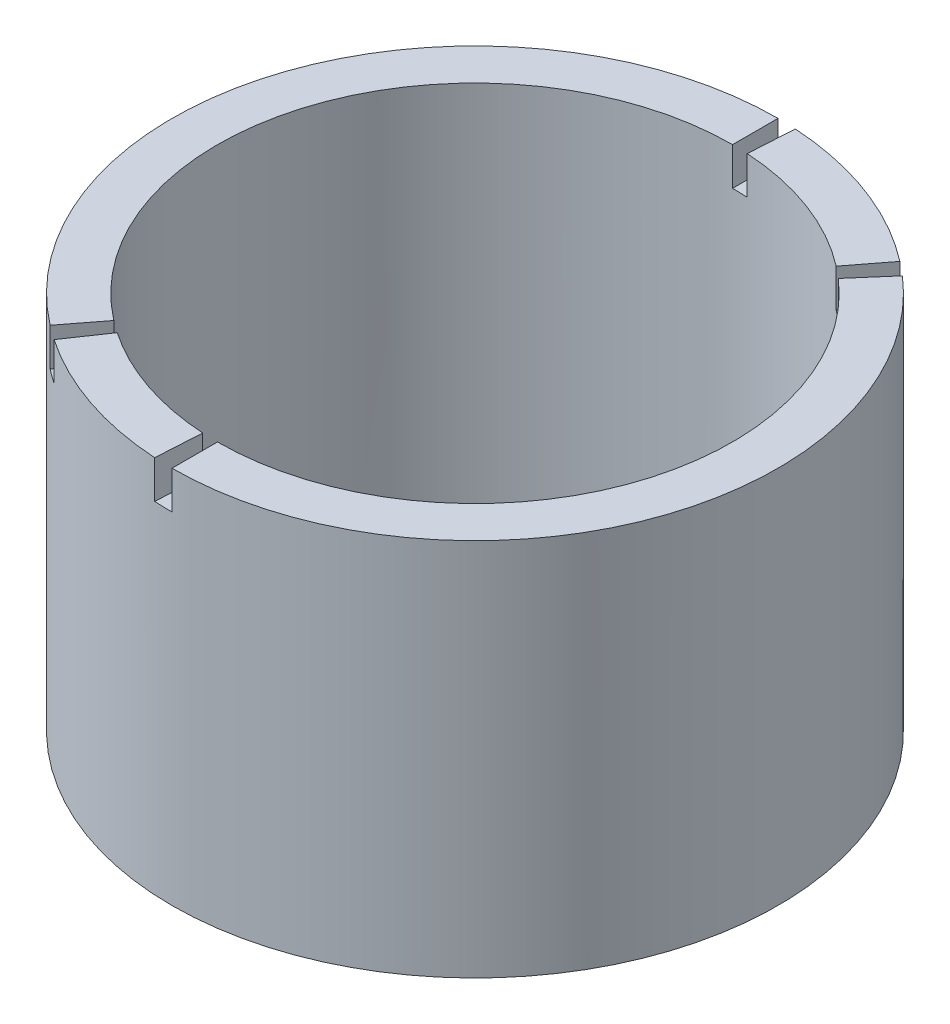
ISO-10303-21;
HEADER;
FILE_DESCRIPTION(('STEP AP214'),'2;1');
FILE_NAME('part.step','',(''),(''),'','','');
FILE_SCHEMA(('AUTOMOTIVE_DESIGN { 1 0 10303 214 1 1 1 1 }'));
ENDSEC;
DATA;
#1=APPLICATION_CONTEXT('core data for automotive mechanical design processes');
#2=APPLICATION_PROTOCOL_DEFINITION('international standard','automotive_design',2000,#1);
#3=PRODUCT_CONTEXT('',#1,'mechanical');
#4=PRODUCT('Part','Part','',(#3));
#5=PRODUCT_RELATED_PRODUCT_CATEGORY('part','',(#4));
#6=PRODUCT_DEFINITION_FORMATION('','',#4);
#7=PRODUCT_DEFINITION_CONTEXT('part definition',#1,'design');
#8=PRODUCT_DEFINITION('design','',#6,#7);
#9=PRODUCT_DEFINITION_SHAPE('','',#8);
#10=(LENGTH_UNIT() NAMED_UNIT(*) SI_UNIT(.MILLI.,.METRE.));
#11=(NAMED_UNIT(*) PLANE_ANGLE_UNIT() SI_UNIT($,.RADIAN.));
#12=(NAMED_UNIT(*) SI_UNIT($,.STERADIAN.) SOLID_ANGLE_UNIT());
#13=UNCERTAINTY_MEASURE_WITH_UNIT(LENGTH_MEASURE(1.E-05),#10,'distance_accuracy_value','');
#14=(GEOMETRIC_REPRESENTATION_CONTEXT(3) GLOBAL_UNCERTAINTY_ASSIGNED_CONTEXT((#13)) GLOBAL_UNIT_ASSIGNED_CONTEXT((#10,
#11,#12)) REPRESENTATION_CONTEXT('',''));
#15=CARTESIAN_POINT('',(0.,0.,0.));
#16=DIRECTION('',(0.,0.,1.));
#17=DIRECTION('',(1.,0.,0.));
#18=AXIS2_PLACEMENT_3D('',#15,#16,#17);
#19=CARTESIAN_POINT('',(0.,50.,0.));
#20=DIRECTION('',(0.,1.,0.));
#21=DIRECTION('',(0.,0.,1.));
#22=AXIS2_PLACEMENT_3D('',#19,#20,#21);
#23=PLANE('',#22);
#24=DIRECTION('',(-0.609890101839661,0.,0.792486002196889));
#25=VECTOR('',#24,1.);
#26=CARTESIAN_POINT('',(-24.3956040735864,50.,31.6994400878756));
#27=LINE('',#26,#25);
#28=CARTESIAN_POINT('',(-20.7362634625485,50.,26.9445240746942));
#29=VERTEX_POINT('',#28);
#30=CARTESIAN_POINT('',(-24.3956040735864,50.,31.6994400878756));
#31=VERTEX_POINT('',#30);
#32=EDGE_CURVE('E161',#29,#31,#27,.T.);
#33=ORIENTED_EDGE('',*,*,#32,.F.);
#34=CARTESIAN_POINT('',(0.,50.,0.));
#35=DIRECTION('',(0.,1.,0.));
#36=DIRECTION('',(0.,0.,1.));
#37=AXIS2_PLACEMENT_3D('',#34,#35,#36);
#38=CIRCLE('',#37,34.);
#39=CARTESIAN_POINT('',(0.,50.,-34.));
#40=VERTEX_POINT('',#39);
#41=EDGE_CURVE('E247',#40,#29,#38,.T.);
#42=ORIENTED_EDGE('',*,*,#41,.F.);
#43=DIRECTION('',(0.,0.,1.));
#44=VECTOR('',#43,1.);
#45=CARTESIAN_POINT('',(0.,50.,-40.));
#46=LINE('',#45,#44);
#47=CARTESIAN_POINT('',(0.,50.,-40.));
#48=VERTEX_POINT('',#47);
#49=EDGE_CURVE('E213',#48,#40,#46,.T.);
#50=ORIENTED_EDGE('',*,*,#49,.F.);
#51=CARTESIAN_POINT('',(0.,50.,0.));
#52=DIRECTION('',(0.,1.,0.));
#53=DIRECTION('',(0.,0.,1.));
#54=AXIS2_PLACEMENT_3D('',#51,#52,#53);
#55=CIRCLE('',#54,40.);
#56=EDGE_CURVE('E11',#48,#31,#55,.T.);
#57=ORIENTED_EDGE('',*,*,#56,.T.);
#58=EDGE_LOOP('',(#33,#42,#50,#57));
#59=FACE_BOUND('',#58,.T.);
#60=ADVANCED_FACE('F31',(#59),#23,.T.);
#61=DIRECTION('',(0.655431584963321,0.,-0.7552545514146));
#62=VECTOR('',#61,1.);
#63=CARTESIAN_POINT('',(26.2172633985329,50.,-30.210182056584));
#64=LINE('',#63,#62);
#65=CARTESIAN_POINT('',(22.2846738887529,50.,-25.6786547480964));
#66=VERTEX_POINT('',#65);
#67=CARTESIAN_POINT('',(26.2172633985329,50.,-30.210182056584));
#68=VERTEX_POINT('',#67);
#69=EDGE_CURVE('E174',#66,#68,#64,.T.);
#70=ORIENTED_EDGE('',*,*,#69,.F.);
#71=CARTESIAN_POINT('',(0.,50.,34.));
#72=VERTEX_POINT('',#71);
#73=EDGE_CURVE('E251',#72,#66,#38,.T.);
#74=ORIENTED_EDGE('',*,*,#73,.F.);
#75=DIRECTION('',(0.,0.,-1.));
#76=VECTOR('',#75,1.);
#77=CARTESIAN_POINT('',(0.,50.,40.));
#78=LINE('',#77,#76);
#79=CARTESIAN_POINT('',(0.,50.,40.));
#80=VERTEX_POINT('',#79);
#81=EDGE_CURVE('E189',#80,#72,#78,.T.);
#82=ORIENTED_EDGE('',*,*,#81,.F.);
#83=EDGE_CURVE('E41',#80,#68,#55,.T.);
#84=ORIENTED_EDGE('',*,*,#83,.T.);
#85=EDGE_LOOP('',(#70,#74,#82,#84));
#86=FACE_BOUND('',#85,.T.);
#87=ADVANCED_FACE('F291',(#86),#23,.T.);
#88=DIRECTION('',(0.562238272342853,0.,-0.826975286881612));
#89=VECTOR('',#88,1.);
#90=CARTESIAN_POINT('',(-22.4895308937141,50.,33.0790114752645));
#91=LINE('',#90,#89);
#92=CARTESIAN_POINT('',(-22.4895308937141,50.,33.0790114752645));
#93=VERTEX_POINT('',#92);
#94=CARTESIAN_POINT('',(-19.116101259657,50.,28.1171597539748));
#95=VERTEX_POINT('',#94);
#96=EDGE_CURVE('E272',#93,#95,#91,.T.);
#97=ORIENTED_EDGE('',*,*,#96,.F.);
#98=CARTESIAN_POINT('',(-2.35294117647058,50.,39.9307358787697));
#99=VERTEX_POINT('',#98);
#100=EDGE_CURVE('E40',#93,#99,#55,.T.);
#101=ORIENTED_EDGE('',*,*,#100,.T.);
#102=DIRECTION('',(-0.0588235294117646,0.,0.998268396969244));
#103=VECTOR('',#102,1.);
#104=CARTESIAN_POINT('',(-2.35294117647058,50.,39.9307358787697));
#105=LINE('',#104,#103);
#106=CARTESIAN_POINT('',(-2.00000000000001,50.,33.9411254969543));
#107=VERTEX_POINT('',#106);
#108=EDGE_CURVE('E200',#107,#99,#105,.T.);
#109=ORIENTED_EDGE('',*,*,#108,.F.);
#110=EDGE_CURVE('E250',#95,#107,#38,.T.);
#111=ORIENTED_EDGE('',*,*,#110,.F.);
#112=EDGE_LOOP('',(#97,#101,#109,#111));
#113=FACE_BOUND('',#112,.T.);
#114=ADVANCED_FACE('F271',(#113),#23,.T.);
#115=DIRECTION('',(-0.609890101839661,0.,0.792486002196889));
#116=VECTOR('',#115,1.);
#117=CARTESIAN_POINT('',(24.3956040735864,50.,-31.6994400878756));
#118=LINE('',#117,#116);
#119=CARTESIAN_POINT('',(24.3956040735864,50.,-31.6994400878756));
#120=VERTEX_POINT('',#119);
#121=CARTESIAN_POINT('',(20.7362634625485,50.,-26.9445240746942));
#122=VERTEX_POINT('',#121);
#123=EDGE_CURVE('E182',#120,#122,#118,.T.);
#124=ORIENTED_EDGE('',*,*,#123,.F.);
#125=CARTESIAN_POINT('',(2.35294117647058,50.,-39.9307358787697));
#126=VERTEX_POINT('',#125);
#127=EDGE_CURVE('E273',#120,#126,#55,.T.);
#128=ORIENTED_EDGE('',*,*,#127,.T.);
#129=DIRECTION('',(0.0588235294117643,0.,-0.998268396969244));
#130=VECTOR('',#129,1.);
#131=CARTESIAN_POINT('',(2.35294117647058,50.,-39.9307358787697));
#132=LINE('',#131,#130);
#133=CARTESIAN_POINT('',(1.99999999999999,50.,-33.9411254969543));
#134=VERTEX_POINT('',#133);
#135=EDGE_CURVE('E225',#134,#126,#132,.T.);
#136=ORIENTED_EDGE('',*,*,#135,.F.);
#137=EDGE_CURVE('E253',#122,#134,#38,.T.);
#138=ORIENTED_EDGE('',*,*,#137,.F.);
#139=EDGE_LOOP('',(#124,#128,#136,#138));
#140=FACE_BOUND('',#139,.T.);
#141=ADVANCED_FACE('F284',(#140),#23,.T.);
#142=CARTESIAN_POINT('',(0.,0.,0.));
#143=DIRECTION('',(0.,1.,0.));
#144=DIRECTION('',(0.,0.,1.));
#145=AXIS2_PLACEMENT_3D('',#142,#143,#144);
#146=PLANE('',#145);
#147=CARTESIAN_POINT('',(0.,0.,0.));
#148=DIRECTION('',(0.,1.,0.));
#149=DIRECTION('',(0.,0.,1.));
#150=AXIS2_PLACEMENT_3D('',#147,#148,#149);
#151=CIRCLE('',#150,40.);
#152=CARTESIAN_POINT('',(0.,0.,40.));
#153=VERTEX_POINT('',#152);
#154=EDGE_CURVE('E35',#153,#153,#151,.T.);
#155=ORIENTED_EDGE('',*,*,#154,.F.);
#156=EDGE_LOOP('',(#155));
#157=FACE_BOUND('',#156,.T.);
#158=CARTESIAN_POINT('',(0.,0.,0.));
#159=DIRECTION('',(0.,1.,0.));
#160=DIRECTION('',(0.,0.,1.));
#161=AXIS2_PLACEMENT_3D('',#158,#159,#160);
#162=CIRCLE('',#161,34.);
#163=CARTESIAN_POINT('',(0.,0.,34.));
#164=VERTEX_POINT('',#163);
#165=EDGE_CURVE('E239',#164,#164,#162,.T.);
#166=ORIENTED_EDGE('',*,*,#165,.T.);
#167=EDGE_LOOP('',(#166));
#168=FACE_BOUND('',#167,.T.);
#169=ADVANCED_FACE('F282',(#157,#168),#146,.F.);
#170=CARTESIAN_POINT('',(0.,50.,0.));
#171=DIRECTION('',(0.,-1.,0.));
#172=DIRECTION('',(0.,0.,-1.));
#173=AXIS2_PLACEMENT_3D('',#170,#171,#172);
#174=CYLINDRICAL_SURFACE('',#173,40.);
#175=CARTESIAN_POINT('',(0.,45.,0.));
#176=DIRECTION('',(0.,1.,0.));
#177=DIRECTION('',(0.,0.,-1.));
#178=AXIS2_PLACEMENT_3D('',#175,#176,#177);
#179=CIRCLE('',#178,40.);
#180=CARTESIAN_POINT('',(-24.3956040735864,45.,31.6994400878756));
#181=VERTEX_POINT('',#180);
#182=CARTESIAN_POINT('',(-22.4895308937141,45.,33.0790114752645));
#183=VERTEX_POINT('',#182);
#184=EDGE_CURVE('E152',#181,#183,#179,.T.);
#185=ORIENTED_EDGE('',*,*,#184,.F.);
#186=DIRECTION('',(0.,1.,0.));
#187=VECTOR('',#186,1.);
#188=CARTESIAN_POINT('',(-24.3956040735864,45.,31.6994400878756));
#189=LINE('',#188,#187);
#190=EDGE_CURVE('E184',#181,#31,#189,.T.);
#191=ORIENTED_EDGE('',*,*,#190,.T.);
#192=ORIENTED_EDGE('',*,*,#56,.F.);
#193=DIRECTION('',(0.,1.,0.));
#194=VECTOR('',#193,1.);
#195=CARTESIAN_POINT('',(0.,45.,-40.));
#196=LINE('',#195,#194);
#197=CARTESIAN_POINT('',(0.,45.,-40.));
#198=VERTEX_POINT('',#197);
#199=EDGE_CURVE('E232',#198,#48,#196,.T.);
#200=ORIENTED_EDGE('',*,*,#199,.F.);
#201=CARTESIAN_POINT('',(0.,45.,0.));
#202=DIRECTION('',(0.,1.,0.));
#203=DIRECTION('',(0.,0.,-1.));
#204=AXIS2_PLACEMENT_3D('',#201,#202,#203);
#205=CIRCLE('',#204,40.);
#206=CARTESIAN_POINT('',(2.35294117647058,45.,-39.9307358787697));
#207=VERTEX_POINT('',#206);
#208=EDGE_CURVE('E221',#207,#198,#205,.T.);
#209=ORIENTED_EDGE('',*,*,#208,.F.);
#210=DIRECTION('',(0.,1.,0.));
#211=VECTOR('',#210,1.);
#212=CARTESIAN_POINT('',(2.35294117647058,45.,-39.9307358787697));
#213=LINE('',#212,#211);
#214=EDGE_CURVE('E236',#207,#126,#213,.T.);
#215=ORIENTED_EDGE('',*,*,#214,.T.);
#216=ORIENTED_EDGE('',*,*,#127,.F.);
#217=DIRECTION('',(0.,1.,0.));
#218=VECTOR('',#217,1.);
#219=CARTESIAN_POINT('',(24.3956040735864,45.,-31.6994400878756));
#220=LINE('',#219,#218);
#221=CARTESIAN_POINT('',(24.3956040735864,45.,-31.6994400878756));
#222=VERTEX_POINT('',#221);
#223=EDGE_CURVE('E181',#222,#120,#220,.T.);
#224=ORIENTED_EDGE('',*,*,#223,.F.);
#225=CARTESIAN_POINT('',(0.,45.,0.));
#226=DIRECTION('',(0.,1.,0.));
#227=DIRECTION('',(0.,0.,-1.));
#228=AXIS2_PLACEMENT_3D('',#225,#226,#227);
#229=CIRCLE('',#228,40.);
#230=CARTESIAN_POINT('',(26.2172633985329,45.,-30.210182056584));
#231=VERTEX_POINT('',#230);
#232=EDGE_CURVE('E172',#231,#222,#229,.T.);
#233=ORIENTED_EDGE('',*,*,#232,.F.);
#234=DIRECTION('',(0.,1.,0.));
#235=VECTOR('',#234,1.);
#236=CARTESIAN_POINT('',(26.2172633985329,45.,-30.210182056584));
#237=LINE('',#236,#235);
#238=EDGE_CURVE('E186',#231,#68,#237,.T.);
#239=ORIENTED_EDGE('',*,*,#238,.T.);
#240=ORIENTED_EDGE('',*,*,#83,.F.);
#241=DIRECTION('',(0.,1.,0.));
#242=VECTOR('',#241,1.);
#243=CARTESIAN_POINT('',(0.,45.,40.));
#244=LINE('',#243,#242);
#245=CARTESIAN_POINT('',(0.,45.,40.));
#246=VERTEX_POINT('',#245);
#247=EDGE_CURVE('E207',#246,#80,#244,.T.);
#248=ORIENTED_EDGE('',*,*,#247,.F.);
#249=CARTESIAN_POINT('',(0.,45.,0.));
#250=DIRECTION('',(0.,1.,0.));
#251=DIRECTION('',(0.,0.,1.));
#252=AXIS2_PLACEMENT_3D('',#249,#250,#251);
#253=CIRCLE('',#252,40.);
#254=CARTESIAN_POINT('',(-2.35294117647058,45.,39.9307358787697));
#255=VERTEX_POINT('',#254);
#256=EDGE_CURVE('E196',#255,#246,#253,.T.);
#257=ORIENTED_EDGE('',*,*,#256,.F.);
#258=DIRECTION('',(0.,1.,0.));
#259=VECTOR('',#258,1.);
#260=CARTESIAN_POINT('',(-2.35294117647058,45.,39.9307358787697));
#261=LINE('',#260,#259);
#262=EDGE_CURVE('E211',#255,#99,#261,.T.);
#263=ORIENTED_EDGE('',*,*,#262,.T.);
#264=ORIENTED_EDGE('',*,*,#100,.F.);
#265=DIRECTION('',(0.,1.,0.));
#266=VECTOR('',#265,1.);
#267=CARTESIAN_POINT('',(-22.4895308937141,45.,33.0790114752645));
#268=LINE('',#267,#266);
#269=EDGE_CURVE('E146',#183,#93,#268,.T.);
#270=ORIENTED_EDGE('',*,*,#269,.F.);
#271=EDGE_LOOP('',(#185,#191,#192,#200,#209,#215,#216,#224,#233,#239,#240,#248,#257,#263,#264,#270));
#272=FACE_BOUND('',#271,.T.);
#273=ORIENTED_EDGE('',*,*,#154,.T.);
#274=EDGE_LOOP('',(#273));
#275=FACE_BOUND('',#274,.T.);
#276=ADVANCED_FACE('F33',(#272,#275),#174,.T.);
#277=CARTESIAN_POINT('',(0.,50.,0.));
#278=DIRECTION('',(0.,-1.,0.));
#279=DIRECTION('',(0.,0.,-1.));
#280=AXIS2_PLACEMENT_3D('',#277,#278,#279);
#281=CYLINDRICAL_SURFACE('',#280,34.);
#282=DIRECTION('',(0.,1.,0.));
#283=VECTOR('',#282,1.);
#284=CARTESIAN_POINT('',(-20.7362634625485,45.,26.9445240746942));
#285=LINE('',#284,#283);
#286=CARTESIAN_POINT('',(-20.7362634625485,45.,26.9445240746942));
#287=VERTEX_POINT('',#286);
#288=EDGE_CURVE('E167',#287,#29,#285,.T.);
#289=ORIENTED_EDGE('',*,*,#288,.F.);
#290=CARTESIAN_POINT('',(0.,45.,0.));
#291=DIRECTION('',(0.,-1.,0.));
#292=DIRECTION('',(0.,0.,-1.));
#293=AXIS2_PLACEMENT_3D('',#290,#291,#292);
#294=CIRCLE('',#293,34.);
#295=CARTESIAN_POINT('',(-19.116101259657,45.,28.1171597539748));
#296=VERTEX_POINT('',#295);
#297=EDGE_CURVE('E151',#296,#287,#294,.T.);
#298=ORIENTED_EDGE('',*,*,#297,.F.);
#299=DIRECTION('',(0.,1.,0.));
#300=VECTOR('',#299,1.);
#301=CARTESIAN_POINT('',(-19.116101259657,45.,28.1171597539748));
#302=LINE('',#301,#300);
#303=EDGE_CURVE('E149',#296,#95,#302,.T.);
#304=ORIENTED_EDGE('',*,*,#303,.T.);
#305=ORIENTED_EDGE('',*,*,#110,.T.);
#306=DIRECTION('',(0.,1.,0.));
#307=VECTOR('',#306,1.);
#308=CARTESIAN_POINT('',(-2.00000000000001,45.,33.9411254969543));
#309=LINE('',#308,#307);
#310=CARTESIAN_POINT('',(-2.00000000000001,45.,33.9411254969543));
#311=VERTEX_POINT('',#310);
#312=EDGE_CURVE('E214',#311,#107,#309,.T.);
#313=ORIENTED_EDGE('',*,*,#312,.F.);
#314=CARTESIAN_POINT('',(0.,45.,0.));
#315=DIRECTION('',(0.,-1.,0.));
#316=DIRECTION('',(0.,0.,1.));
#317=AXIS2_PLACEMENT_3D('',#314,#315,#316);
#318=CIRCLE('',#317,34.);
#319=CARTESIAN_POINT('',(0.,45.,34.));
#320=VERTEX_POINT('',#319);
#321=EDGE_CURVE('E202',#320,#311,#318,.T.);
#322=ORIENTED_EDGE('',*,*,#321,.F.);
#323=DIRECTION('',(0.,1.,0.));
#324=VECTOR('',#323,1.);
#325=CARTESIAN_POINT('',(0.,45.,34.));
#326=LINE('',#325,#324);
#327=EDGE_CURVE('E217',#320,#72,#326,.T.);
#328=ORIENTED_EDGE('',*,*,#327,.T.);
#329=ORIENTED_EDGE('',*,*,#73,.T.);
#330=DIRECTION('',(0.,1.,0.));
#331=VECTOR('',#330,1.);
#332=CARTESIAN_POINT('',(22.2846738887529,45.,-25.6786547480964));
#333=LINE('',#332,#331);
#334=CARTESIAN_POINT('',(22.2846738887529,45.,-25.6786547480964));
#335=VERTEX_POINT('',#334);
#336=EDGE_CURVE('E190',#335,#66,#333,.T.);
#337=ORIENTED_EDGE('',*,*,#336,.F.);
#338=CARTESIAN_POINT('',(0.,45.,0.));
#339=DIRECTION('',(0.,-1.,0.));
#340=DIRECTION('',(0.,0.,-1.));
#341=AXIS2_PLACEMENT_3D('',#338,#339,#340);
#342=CIRCLE('',#341,34.);
#343=CARTESIAN_POINT('',(20.7362634625485,45.,-26.9445240746942));
#344=VERTEX_POINT('',#343);
#345=EDGE_CURVE('E176',#344,#335,#342,.T.);
#346=ORIENTED_EDGE('',*,*,#345,.F.);
#347=DIRECTION('',(0.,1.,0.));
#348=VECTOR('',#347,1.);
#349=CARTESIAN_POINT('',(20.7362634625485,45.,-26.9445240746942));
#350=LINE('',#349,#348);
#351=EDGE_CURVE('E192',#344,#122,#350,.T.);
#352=ORIENTED_EDGE('',*,*,#351,.T.);
#353=ORIENTED_EDGE('',*,*,#137,.T.);
#354=DIRECTION('',(0.,1.,0.));
#355=VECTOR('',#354,1.);
#356=CARTESIAN_POINT('',(1.99999999999999,45.,-33.9411254969543));
#357=LINE('',#356,#355);
#358=CARTESIAN_POINT('',(1.99999999999999,45.,-33.9411254969543));
#359=VERTEX_POINT('',#358);
#360=EDGE_CURVE('E240',#359,#134,#357,.T.);
#361=ORIENTED_EDGE('',*,*,#360,.F.);
#362=CARTESIAN_POINT('',(0.,45.,0.));
#363=DIRECTION('',(0.,-1.,0.));
#364=DIRECTION('',(0.,0.,-1.));
#365=AXIS2_PLACEMENT_3D('',#362,#363,#364);
#366=CIRCLE('',#365,34.);
#367=CARTESIAN_POINT('',(0.,45.,-34.));
#368=VERTEX_POINT('',#367);
#369=EDGE_CURVE('E227',#368,#359,#366,.T.);
#370=ORIENTED_EDGE('',*,*,#369,.F.);
#371=DIRECTION('',(0.,1.,0.));
#372=VECTOR('',#371,1.);
#373=CARTESIAN_POINT('',(0.,45.,-34.));
#374=LINE('',#373,#372);
#375=EDGE_CURVE('E243',#368,#40,#374,.T.);
#376=ORIENTED_EDGE('',*,*,#375,.T.);
#377=ORIENTED_EDGE('',*,*,#41,.T.);
#378=EDGE_LOOP('',(#289,#298,#304,#305,#313,#322,#328,#329,#337,#346,#352,#353,#361,#370,#376,#377));
#379=FACE_BOUND('',#378,.T.);
#380=ORIENTED_EDGE('',*,*,#165,.F.);
#381=EDGE_LOOP('',(#380));
#382=FACE_BOUND('',#381,.T.);
#383=ADVANCED_FACE('F263',(#379,#382),#281,.F.);
#384=CARTESIAN_POINT('',(2.35294117647058,45.,-39.9307358787697));
#385=DIRECTION('',(0.998268396969244,0.,0.0588235294117643));
#386=DIRECTION('',(0.0588235294117643,0.,-0.998268396969244));
#387=AXIS2_PLACEMENT_3D('',#384,#385,#386);
#388=PLANE('',#387);
#389=ORIENTED_EDGE('',*,*,#135,.T.);
#390=ORIENTED_EDGE('',*,*,#214,.F.);
#391=DIRECTION('',(0.0588235294117643,0.,-0.998268396969244));
#392=VECTOR('',#391,1.);
#393=CARTESIAN_POINT('',(2.35294117647058,45.,-39.9307358787697));
#394=LINE('',#393,#392);
#395=EDGE_CURVE('E229',#359,#207,#394,.T.);
#396=ORIENTED_EDGE('',*,*,#395,.F.);
#397=ORIENTED_EDGE('',*,*,#360,.T.);
#398=EDGE_LOOP('',(#389,#390,#396,#397));
#399=FACE_BOUND('',#398,.T.);
#400=ADVANCED_FACE('F301',(#399),#388,.F.);
#401=CARTESIAN_POINT('',(0.,45.,-40.));
#402=DIRECTION('',(-1.,0.,0.));
#403=DIRECTION('',(0.,0.,1.));
#404=AXIS2_PLACEMENT_3D('',#401,#402,#403);
#405=PLANE('',#404);
#406=ORIENTED_EDGE('',*,*,#49,.T.);
#407=ORIENTED_EDGE('',*,*,#375,.F.);
#408=DIRECTION('',(0.,0.,1.));
#409=VECTOR('',#408,1.);
#410=CARTESIAN_POINT('',(0.,45.,-40.));
#411=LINE('',#410,#409);
#412=EDGE_CURVE('E224',#198,#368,#411,.T.);
#413=ORIENTED_EDGE('',*,*,#412,.F.);
#414=ORIENTED_EDGE('',*,*,#199,.T.);
#415=EDGE_LOOP('',(#406,#407,#413,#414));
#416=FACE_BOUND('',#415,.T.);
#417=ADVANCED_FACE('F302',(#416),#405,.F.);
#418=CARTESIAN_POINT('',(0.,45.,0.));
#419=DIRECTION('',(0.,-1.,0.));
#420=DIRECTION('',(0.,0.,-1.));
#421=AXIS2_PLACEMENT_3D('',#418,#419,#420);
#422=PLANE('',#421);
#423=ORIENTED_EDGE('',*,*,#208,.T.);
#424=ORIENTED_EDGE('',*,*,#412,.T.);
#425=ORIENTED_EDGE('',*,*,#369,.T.);
#426=ORIENTED_EDGE('',*,*,#395,.T.);
#427=EDGE_LOOP('',(#423,#424,#425,#426));
#428=FACE_BOUND('',#427,.T.);
#429=ADVANCED_FACE('F305',(#428),#422,.F.);
#430=CARTESIAN_POINT('',(-2.35294117647058,45.,39.9307358787697));
#431=DIRECTION('',(-0.998268396969244,0.,-0.0588235294117646));
#432=DIRECTION('',(-0.0588235294117646,0.,0.998268396969244));
#433=AXIS2_PLACEMENT_3D('',#430,#431,#432);
#434=PLANE('',#433);
#435=ORIENTED_EDGE('',*,*,#108,.T.);
#436=ORIENTED_EDGE('',*,*,#262,.F.);
#437=DIRECTION('',(-0.0588235294117646,0.,0.998268396969244));
#438=VECTOR('',#437,1.);
#439=CARTESIAN_POINT('',(-2.35294117647058,45.,39.9307358787697));
#440=LINE('',#439,#438);
#441=EDGE_CURVE('E204',#311,#255,#440,.T.);
#442=ORIENTED_EDGE('',*,*,#441,.F.);
#443=ORIENTED_EDGE('',*,*,#312,.T.);
#444=EDGE_LOOP('',(#435,#436,#442,#443));
#445=FACE_BOUND('',#444,.T.);
#446=ADVANCED_FACE('F270',(#445),#434,.F.);
#447=CARTESIAN_POINT('',(0.,45.,40.));
#448=DIRECTION('',(1.,0.,0.));
#449=DIRECTION('',(0.,0.,-1.));
#450=AXIS2_PLACEMENT_3D('',#447,#448,#449);
#451=PLANE('',#450);
#452=ORIENTED_EDGE('',*,*,#81,.T.);
#453=ORIENTED_EDGE('',*,*,#327,.F.);
#454=DIRECTION('',(0.,0.,-1.));
#455=VECTOR('',#454,1.);
#456=CARTESIAN_POINT('',(0.,45.,40.));
#457=LINE('',#456,#455);
#458=EDGE_CURVE('E199',#246,#320,#457,.T.);
#459=ORIENTED_EDGE('',*,*,#458,.F.);
#460=ORIENTED_EDGE('',*,*,#247,.T.);
#461=EDGE_LOOP('',(#452,#453,#459,#460));
#462=FACE_BOUND('',#461,.T.);
#463=ADVANCED_FACE('F313',(#462),#451,.F.);
#464=CARTESIAN_POINT('',(0.,45.,0.));
#465=DIRECTION('',(0.,1.,0.));
#466=DIRECTION('',(0.,0.,1.));
#467=AXIS2_PLACEMENT_3D('',#464,#465,#466);
#468=PLANE('',#467);
#469=ORIENTED_EDGE('',*,*,#256,.T.);
#470=ORIENTED_EDGE('',*,*,#458,.T.);
#471=ORIENTED_EDGE('',*,*,#321,.T.);
#472=ORIENTED_EDGE('',*,*,#441,.T.);
#473=EDGE_LOOP('',(#469,#470,#471,#472));
#474=FACE_BOUND('',#473,.T.);
#475=ADVANCED_FACE('F316',(#474),#468,.T.);
#476=CARTESIAN_POINT('',(26.2172633985329,45.,-30.210182056584));
#477=DIRECTION('',(0.7552545514146,0.,0.655431584963321));
#478=DIRECTION('',(0.655431584963321,0.,-0.7552545514146));
#479=AXIS2_PLACEMENT_3D('',#476,#477,#478);
#480=PLANE('',#479);
#481=ORIENTED_EDGE('',*,*,#69,.T.);
#482=ORIENTED_EDGE('',*,*,#238,.F.);
#483=DIRECTION('',(0.655431584963321,0.,-0.7552545514146));
#484=VECTOR('',#483,1.);
#485=CARTESIAN_POINT('',(26.2172633985329,45.,-30.210182056584));
#486=LINE('',#485,#484);
#487=EDGE_CURVE('E178',#335,#231,#486,.T.);
#488=ORIENTED_EDGE('',*,*,#487,.F.);
#489=ORIENTED_EDGE('',*,*,#336,.T.);
#490=EDGE_LOOP('',(#481,#482,#488,#489));
#491=FACE_BOUND('',#490,.T.);
#492=ADVANCED_FACE('F322',(#491),#480,.F.);
#493=CARTESIAN_POINT('',(24.3956040735864,45.,-31.6994400878756));
#494=DIRECTION('',(-0.792486002196889,0.,-0.609890101839661));
#495=DIRECTION('',(-0.609890101839661,0.,0.79248600219689));
#496=AXIS2_PLACEMENT_3D('',#493,#494,#495);
#497=PLANE('',#496);
#498=ORIENTED_EDGE('',*,*,#123,.T.);
#499=ORIENTED_EDGE('',*,*,#351,.F.);
#500=DIRECTION('',(-0.609890101839661,0.,0.792486002196889));
#501=VECTOR('',#500,1.);
#502=CARTESIAN_POINT('',(24.3956040735864,45.,-31.6994400878756));
#503=LINE('',#502,#501);
#504=EDGE_CURVE('E56',#222,#344,#503,.T.);
#505=ORIENTED_EDGE('',*,*,#504,.F.);
#506=ORIENTED_EDGE('',*,*,#223,.T.);
#507=EDGE_LOOP('',(#498,#499,#505,#506));
#508=FACE_BOUND('',#507,.T.);
#509=ADVANCED_FACE('F324',(#508),#497,.F.);
#510=CARTESIAN_POINT('',(0.,45.,0.));
#511=DIRECTION('',(0.,-1.,0.));
#512=DIRECTION('',(0.,0.,-1.));
#513=AXIS2_PLACEMENT_3D('',#510,#511,#512);
#514=PLANE('',#513);
#515=ORIENTED_EDGE('',*,*,#232,.T.);
#516=ORIENTED_EDGE('',*,*,#504,.T.);
#517=ORIENTED_EDGE('',*,*,#345,.T.);
#518=ORIENTED_EDGE('',*,*,#487,.T.);
#519=EDGE_LOOP('',(#515,#516,#517,#518));
#520=FACE_BOUND('',#519,.T.);
#521=ADVANCED_FACE('F327',(#520),#514,.F.);
#522=CARTESIAN_POINT('',(-24.3956040735864,45.,31.6994400878756));
#523=DIRECTION('',(-0.792486002196889,0.,-0.609890101839661));
#524=DIRECTION('',(-0.609890101839661,0.,0.792486002196889));
#525=AXIS2_PLACEMENT_3D('',#522,#523,#524);
#526=PLANE('',#525);
#527=ORIENTED_EDGE('',*,*,#32,.T.);
#528=ORIENTED_EDGE('',*,*,#190,.F.);
#529=DIRECTION('',(-0.609890101839661,0.,0.792486002196889));
#530=VECTOR('',#529,1.);
#531=CARTESIAN_POINT('',(-24.3956040735864,45.,31.6994400878756));
#532=LINE('',#531,#530);
#533=EDGE_CURVE('E158',#287,#181,#532,.T.);
#534=ORIENTED_EDGE('',*,*,#533,.F.);
#535=ORIENTED_EDGE('',*,*,#288,.T.);
#536=EDGE_LOOP('',(#527,#528,#534,#535));
#537=FACE_BOUND('',#536,.T.);
#538=ADVANCED_FACE('F334',(#537),#526,.F.);
#539=CARTESIAN_POINT('',(-22.4895308937141,45.,33.0790114752645));
#540=DIRECTION('',(0.826975286881612,0.,0.562238272342853));
#541=DIRECTION('',(0.562238272342853,0.,-0.826975286881612));
#542=AXIS2_PLACEMENT_3D('',#539,#540,#541);
#543=PLANE('',#542);
#544=ORIENTED_EDGE('',*,*,#96,.T.);
#545=ORIENTED_EDGE('',*,*,#303,.F.);
#546=DIRECTION('',(0.562238272342853,0.,-0.826975286881612));
#547=VECTOR('',#546,1.);
#548=CARTESIAN_POINT('',(-22.4895308937141,45.,33.0790114752645));
#549=LINE('',#548,#547);
#550=EDGE_CURVE('E48',#183,#296,#549,.T.);
#551=ORIENTED_EDGE('',*,*,#550,.F.);
#552=ORIENTED_EDGE('',*,*,#269,.T.);
#553=EDGE_LOOP('',(#544,#545,#551,#552));
#554=FACE_BOUND('',#553,.T.);
#555=ADVANCED_FACE('F144',(#554),#543,.F.);
#556=CARTESIAN_POINT('',(0.,45.,0.));
#557=DIRECTION('',(0.,-1.,0.));
#558=DIRECTION('',(0.,0.,-1.));
#559=AXIS2_PLACEMENT_3D('',#556,#557,#558);
#560=PLANE('',#559);
#561=ORIENTED_EDGE('',*,*,#184,.T.);
#562=ORIENTED_EDGE('',*,*,#550,.T.);
#563=ORIENTED_EDGE('',*,*,#297,.T.);
#564=ORIENTED_EDGE('',*,*,#533,.T.);
#565=EDGE_LOOP('',(#561,#562,#563,#564));
#566=FACE_BOUND('',#565,.T.);
#567=ADVANCED_FACE('F156',(#566),#560,.F.);
#568=CLOSED_SHELL('',(#60,#87,#114,#141,#169,#276,#383,#400,#417,#429,#446,#463,#475,#492,#509,
#521,#538,#555,#567));
#569=MANIFOLD_SOLID_BREP('B2',#568);
#570=ADVANCED_BREP_SHAPE_REPRESENTATION('',(#18,#569),#14);
#571=SHAPE_DEFINITION_REPRESENTATION(#9,#570);
ENDSEC;
END-ISO-10303-21;
